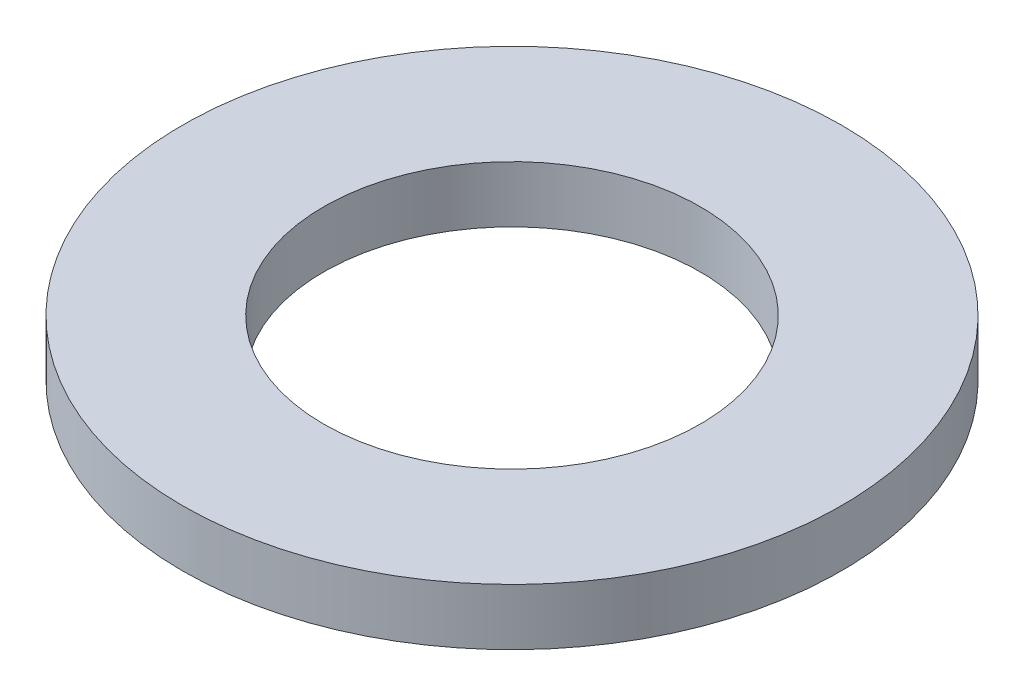
ISO-10303-21;
HEADER;
FILE_DESCRIPTION(('STEP AP214'),'2;1');
FILE_NAME('part.step','',(''),(''),'','','');
FILE_SCHEMA(('AUTOMOTIVE_DESIGN { 1 0 10303 214 1 1 1 1 }'));
ENDSEC;
DATA;
#1=APPLICATION_CONTEXT('core data for automotive mechanical design processes');
#2=APPLICATION_PROTOCOL_DEFINITION('international standard','automotive_design',2000,#1);
#3=PRODUCT_CONTEXT('',#1,'mechanical');
#4=PRODUCT('Part','Part','',(#3));
#5=PRODUCT_RELATED_PRODUCT_CATEGORY('part','',(#4));
#6=PRODUCT_DEFINITION_FORMATION('','',#4);
#7=PRODUCT_DEFINITION_CONTEXT('part definition',#1,'design');
#8=PRODUCT_DEFINITION('design','',#6,#7);
#9=PRODUCT_DEFINITION_SHAPE('','',#8);
#10=(LENGTH_UNIT() NAMED_UNIT(*) SI_UNIT(.MILLI.,.METRE.));
#11=(NAMED_UNIT(*) PLANE_ANGLE_UNIT() SI_UNIT($,.RADIAN.));
#12=(NAMED_UNIT(*) SI_UNIT($,.STERADIAN.) SOLID_ANGLE_UNIT());
#13=UNCERTAINTY_MEASURE_WITH_UNIT(LENGTH_MEASURE(1.E-05),#10,'distance_accuracy_value','');
#14=(GEOMETRIC_REPRESENTATION_CONTEXT(3) GLOBAL_UNCERTAINTY_ASSIGNED_CONTEXT((#13)) GLOBAL_UNIT_ASSIGNED_CONTEXT((#10,
#11,#12)) REPRESENTATION_CONTEXT('',''));
#15=CARTESIAN_POINT('',(0.,0.,0.));
#16=DIRECTION('',(0.,0.,1.));
#17=DIRECTION('',(1.,0.,0.));
#18=AXIS2_PLACEMENT_3D('',#15,#16,#17);
#19=CARTESIAN_POINT('',(0.,12.,0.));
#20=DIRECTION('',(0.,-1.,0.));
#21=DIRECTION('',(0.,0.,-1.));
#22=AXIS2_PLACEMENT_3D('',#19,#20,#21);
#23=CYLINDRICAL_SURFACE('',#22,70.);
#24=CARTESIAN_POINT('',(0.,12.,0.));
#25=DIRECTION('',(0.,1.,0.));
#26=DIRECTION('',(0.,0.,1.));
#27=AXIS2_PLACEMENT_3D('',#24,#25,#26);
#28=CIRCLE('',#27,70.);
#29=CARTESIAN_POINT('',(0.,12.,70.));
#30=VERTEX_POINT('',#29);
#31=EDGE_CURVE('E10',#30,#30,#28,.T.);
#32=ORIENTED_EDGE('',*,*,#31,.F.);
#33=EDGE_LOOP('',(#32));
#34=FACE_BOUND('',#33,.T.);
#35=CARTESIAN_POINT('',(0.,0.,0.));
#36=DIRECTION('',(0.,1.,0.));
#37=DIRECTION('',(0.,0.,1.));
#38=AXIS2_PLACEMENT_3D('',#35,#36,#37);
#39=CIRCLE('',#38,70.);
#40=CARTESIAN_POINT('',(0.,0.,70.));
#41=VERTEX_POINT('',#40);
#42=EDGE_CURVE('E37',#41,#41,#39,.T.);
#43=ORIENTED_EDGE('',*,*,#42,.T.);
#44=EDGE_LOOP('',(#43));
#45=FACE_BOUND('',#44,.T.);
#46=ADVANCED_FACE('F40',(#34,#45),#23,.T.);
#47=CARTESIAN_POINT('',(0.,12.,0.));
#48=DIRECTION('',(0.,1.,0.));
#49=DIRECTION('',(0.,0.,1.));
#50=AXIS2_PLACEMENT_3D('',#47,#48,#49);
#51=PLANE('',#50);
#52=CARTESIAN_POINT('',(0.,12.,0.));
#53=DIRECTION('',(0.,1.,0.));
#54=DIRECTION('',(0.,0.,1.));
#55=AXIS2_PLACEMENT_3D('',#52,#53,#54);
#56=CIRCLE('',#55,40.);
#57=CARTESIAN_POINT('',(0.,12.,40.));
#58=VERTEX_POINT('',#57);
#59=EDGE_CURVE('E50',#58,#58,#56,.T.);
#60=ORIENTED_EDGE('',*,*,#59,.F.);
#61=EDGE_LOOP('',(#60));
#62=FACE_BOUND('',#61,.T.);
#63=ORIENTED_EDGE('',*,*,#31,.T.);
#64=EDGE_LOOP('',(#63));
#65=FACE_BOUND('',#64,.T.);
#66=ADVANCED_FACE('F59',(#62,#65),#51,.T.);
#67=CARTESIAN_POINT('',(0.,0.,0.));
#68=DIRECTION('',(0.,1.,0.));
#69=DIRECTION('',(0.,0.,1.));
#70=AXIS2_PLACEMENT_3D('',#67,#68,#69);
#71=PLANE('',#70);
#72=CARTESIAN_POINT('',(0.,0.,0.));
#73=DIRECTION('',(0.,1.,0.));
#74=DIRECTION('',(0.,0.,1.));
#75=AXIS2_PLACEMENT_3D('',#72,#73,#74);
#76=CIRCLE('',#75,40.);
#77=CARTESIAN_POINT('',(0.,0.,40.));
#78=VERTEX_POINT('',#77);
#79=EDGE_CURVE('E47',#78,#78,#76,.T.);
#80=ORIENTED_EDGE('',*,*,#79,.T.);
#81=EDGE_LOOP('',(#80));
#82=FACE_BOUND('',#81,.T.);
#83=ORIENTED_EDGE('',*,*,#42,.F.);
#84=EDGE_LOOP('',(#83));
#85=FACE_BOUND('',#84,.T.);
#86=ADVANCED_FACE('F58',(#82,#85),#71,.F.);
#87=CARTESIAN_POINT('',(0.,12.,0.));
#88=DIRECTION('',(0.,-1.,0.));
#89=DIRECTION('',(0.,0.,-1.));
#90=AXIS2_PLACEMENT_3D('',#87,#88,#89);
#91=CYLINDRICAL_SURFACE('',#90,40.);
#92=ORIENTED_EDGE('',*,*,#59,.T.);
#93=EDGE_LOOP('',(#92));
#94=FACE_BOUND('',#93,.T.);
#95=ORIENTED_EDGE('',*,*,#79,.F.);
#96=EDGE_LOOP('',(#95));
#97=FACE_BOUND('',#96,.T.);
#98=ADVANCED_FACE('F54',(#94,#97),#91,.F.);
#99=CLOSED_SHELL('',(#46,#66,#86,#98));
#100=MANIFOLD_SOLID_BREP('B2',#99);
#101=ADVANCED_BREP_SHAPE_REPRESENTATION('',(#18,#100),#14);
#102=SHAPE_DEFINITION_REPRESENTATION(#9,#101);
ENDSEC;
END-ISO-10303-21;
